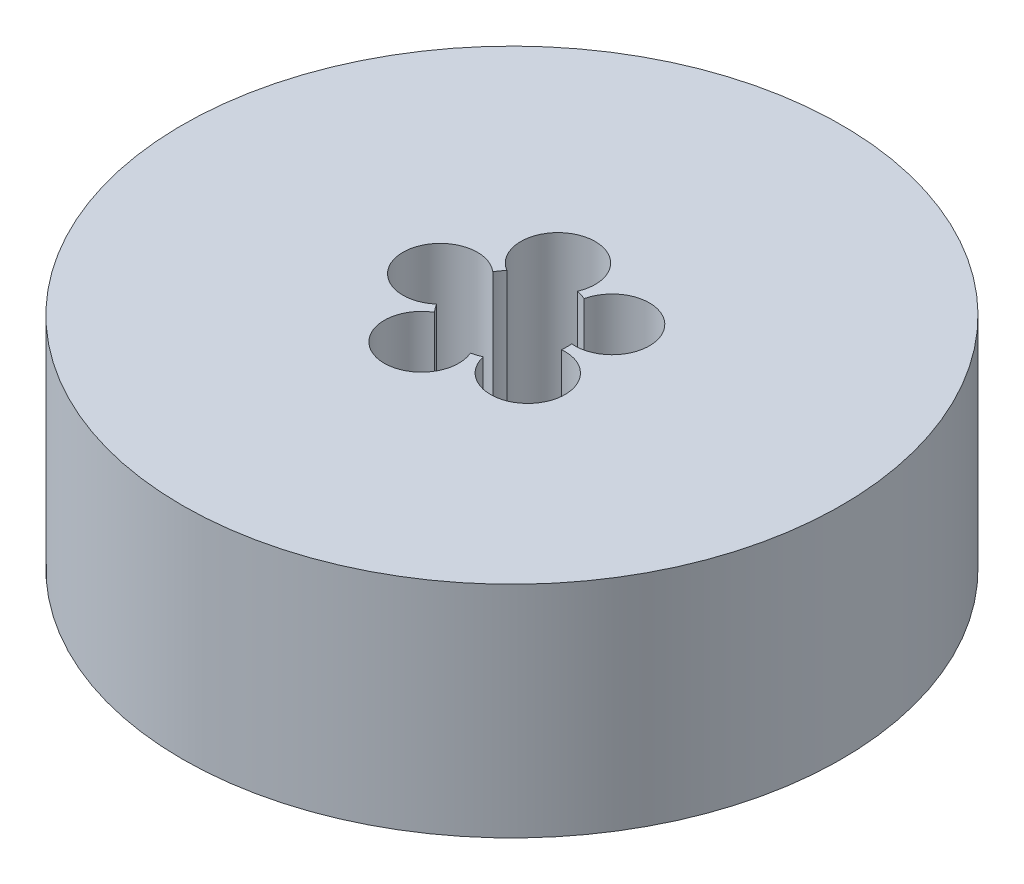
ISO-10303-21;
HEADER;
FILE_DESCRIPTION(('STEP AP214'),'2;1');
FILE_NAME('part.step','',(''),(''),'','','');
FILE_SCHEMA(('AUTOMOTIVE_DESIGN { 1 0 10303 214 1 1 1 1 }'));
ENDSEC;
DATA;
#1=APPLICATION_CONTEXT('core data for automotive mechanical design processes');
#2=APPLICATION_PROTOCOL_DEFINITION('international standard','automotive_design',2000,#1);
#3=PRODUCT_CONTEXT('',#1,'mechanical');
#4=PRODUCT('Part','Part','',(#3));
#5=PRODUCT_RELATED_PRODUCT_CATEGORY('part','',(#4));
#6=PRODUCT_DEFINITION_FORMATION('','',#4);
#7=PRODUCT_DEFINITION_CONTEXT('part definition',#1,'design');
#8=PRODUCT_DEFINITION('design','',#6,#7);
#9=PRODUCT_DEFINITION_SHAPE('','',#8);
#10=(LENGTH_UNIT() NAMED_UNIT(*) SI_UNIT(.MILLI.,.METRE.));
#11=(NAMED_UNIT(*) PLANE_ANGLE_UNIT() SI_UNIT($,.RADIAN.));
#12=(NAMED_UNIT(*) SI_UNIT($,.STERADIAN.) SOLID_ANGLE_UNIT());
#13=UNCERTAINTY_MEASURE_WITH_UNIT(LENGTH_MEASURE(1.E-05),#10,'distance_accuracy_value','');
#14=(GEOMETRIC_REPRESENTATION_CONTEXT(3) GLOBAL_UNCERTAINTY_ASSIGNED_CONTEXT((#13)) GLOBAL_UNIT_ASSIGNED_CONTEXT((#10,
#11,#12)) REPRESENTATION_CONTEXT('',''));
#15=CARTESIAN_POINT('',(0.,0.,0.));
#16=DIRECTION('',(0.,0.,1.));
#17=DIRECTION('',(1.,0.,0.));
#18=AXIS2_PLACEMENT_3D('',#15,#16,#17);
#19=CARTESIAN_POINT('',(0.,30.,0.));
#20=DIRECTION('',(0.,-1.,0.));
#21=DIRECTION('',(0.,0.,-1.));
#22=AXIS2_PLACEMENT_3D('',#19,#20,#21);
#23=CYLINDRICAL_SURFACE('',#22,45.);
#24=CARTESIAN_POINT('',(0.,30.,0.));
#25=DIRECTION('',(0.,1.,0.));
#26=DIRECTION('',(0.,0.,1.));
#27=AXIS2_PLACEMENT_3D('',#24,#25,#26);
#28=CIRCLE('',#27,45.);
#29=CARTESIAN_POINT('',(0.,30.,45.));
#30=VERTEX_POINT('',#29);
#31=EDGE_CURVE('E157',#30,#30,#28,.T.);
#32=ORIENTED_EDGE('',*,*,#31,.F.);
#33=EDGE_LOOP('',(#32));
#34=FACE_BOUND('',#33,.T.);
#35=CARTESIAN_POINT('',(0.,0.,0.));
#36=DIRECTION('',(0.,1.,0.));
#37=DIRECTION('',(0.,0.,1.));
#38=AXIS2_PLACEMENT_3D('',#35,#36,#37);
#39=CIRCLE('',#38,45.);
#40=CARTESIAN_POINT('',(0.,0.,45.));
#41=VERTEX_POINT('',#40);
#42=EDGE_CURVE('E150',#41,#41,#39,.T.);
#43=ORIENTED_EDGE('',*,*,#42,.T.);
#44=EDGE_LOOP('',(#43));
#45=FACE_BOUND('',#44,.T.);
#46=ADVANCED_FACE('F39',(#34,#45),#23,.T.);
#47=CARTESIAN_POINT('',(0.,30.,0.));
#48=DIRECTION('',(0.,1.,0.));
#49=DIRECTION('',(0.,0.,1.));
#50=AXIS2_PLACEMENT_3D('',#47,#48,#49);
#51=PLANE('',#50);
#52=CARTESIAN_POINT('',(-3.02745629020434,30.,-9.31755238387919));
#53=DIRECTION('',(0.,1.,0.));
#54=DIRECTION('',(-0.95105651629515,0.,0.309016994374958));
#55=AXIS2_PLACEMENT_3D('',#52,#53,#54);
#56=CIRCLE('',#55,5.08681048643422);
#57=CARTESIAN_POINT('',(1.64920328847724,30.,-7.3164286720555));
#58=VERTEX_POINT('',#57);
#59=CARTESIAN_POINT('',(-5.63472236044128,30.,-4.94973776282573));
#60=VERTEX_POINT('',#59);
#61=EDGE_CURVE('E194',#58,#60,#56,.T.);
#62=ORIENTED_EDGE('',*,*,#61,.F.);
#63=CARTESIAN_POINT('',(0.,30.,0.));
#64=DIRECTION('',(0.,1.,0.));
#65=DIRECTION('',(0.,0.,1.));
#66=AXIS2_PLACEMENT_3D('',#63,#64,#65);
#67=CIRCLE('',#66,7.5);
#68=CARTESIAN_POINT('',(2.96625538532675,30.,-6.88849250482426));
#69=VERTEX_POINT('',#68);
#70=EDGE_CURVE('E147',#69,#58,#67,.T.);
#71=ORIENTED_EDGE('',*,*,#70,.F.);
#72=CARTESIAN_POINT('',(7.92598346720929,30.,-5.75856406519504));
#73=DIRECTION('',(0.,1.,0.));
#74=DIRECTION('',(-0.58778525229248,0.,-0.809016994374942));
#75=AXIS2_PLACEMENT_3D('',#72,#73,#74);
#76=CIRCLE('',#75,5.08681048643422);
#77=CARTESIAN_POINT('',(7.4679690078856,30.,-0.692415263595586));
#78=VERTEX_POINT('',#77);
#79=EDGE_CURVE('E254',#78,#69,#76,.T.);
#80=ORIENTED_EDGE('',*,*,#79,.F.);
#81=CARTESIAN_POINT('',(7.46796900788561,30.,0.692415263595479));
#82=VERTEX_POINT('',#81);
#83=EDGE_CURVE('E144',#82,#78,#67,.T.);
#84=ORIENTED_EDGE('',*,*,#83,.F.);
#85=CARTESIAN_POINT('',(7.92598346720937,30.,5.75856406519493));
#86=DIRECTION('',(0.,1.,0.));
#87=DIRECTION('',(0.587785252292469,0.,-0.809016994374951));
#88=AXIS2_PLACEMENT_3D('',#85,#86,#87);
#89=CIRCLE('',#88,5.08681048643422);
#90=CARTESIAN_POINT('',(2.96625538532685,30.,6.88849250482422));
#91=VERTEX_POINT('',#90);
#92=EDGE_CURVE('E141',#91,#82,#89,.T.);
#93=ORIENTED_EDGE('',*,*,#92,.F.);
#94=CARTESIAN_POINT('',(1.64920328847734,30.,7.31642867205548));
#95=VERTEX_POINT('',#94);
#96=EDGE_CURVE('E134',#95,#91,#67,.T.);
#97=ORIENTED_EDGE('',*,*,#96,.F.);
#98=CARTESIAN_POINT('',(-3.02745629020421,30.,9.31755238387924));
#99=DIRECTION('',(0.,1.,0.));
#100=DIRECTION('',(0.951056516295155,0.,0.309016994374945));
#101=AXIS2_PLACEMENT_3D('',#98,#99,#100);
#102=CIRCLE('',#101,5.08681048643422);
#103=CARTESIAN_POINT('',(-5.6347223604412,30.,4.94973776282581));
#104=VERTEX_POINT('',#103);
#105=EDGE_CURVE('E111',#104,#95,#102,.T.);
#106=ORIENTED_EDGE('',*,*,#105,.F.);
#107=CARTESIAN_POINT('',(-6.44870532124852,30.,3.82938633199903));
#108=VERTEX_POINT('',#107);
#109=EDGE_CURVE('E145',#108,#104,#67,.T.);
#110=ORIENTED_EDGE('',*,*,#109,.F.);
#111=CARTESIAN_POINT('',(-9.79705435401022,30.,0.));
#112=DIRECTION('',(0.,1.,0.));
#113=DIRECTION('',(0.,0.,1.));
#114=AXIS2_PLACEMENT_3D('',#111,#112,#113);
#115=CIRCLE('',#114,5.08681048643422);
#116=CARTESIAN_POINT('',(-6.44870532124852,30.,-3.82938633199903));
#117=VERTEX_POINT('',#116);
#118=EDGE_CURVE('E153',#117,#108,#115,.T.);
#119=ORIENTED_EDGE('',*,*,#118,.F.);
#120=EDGE_CURVE('E146',#60,#117,#67,.T.);
#121=ORIENTED_EDGE('',*,*,#120,.F.);
#122=EDGE_LOOP('',(#62,#71,#80,#84,#93,#97,#106,#110,#119,#121));
#123=FACE_BOUND('',#122,.T.);
#124=ORIENTED_EDGE('',*,*,#31,.T.);
#125=EDGE_LOOP('',(#124));
#126=FACE_BOUND('',#125,.T.);
#127=ADVANCED_FACE('F139',(#123,#126),#51,.T.);
#128=CARTESIAN_POINT('',(0.,0.,0.));
#129=DIRECTION('',(0.,1.,0.));
#130=DIRECTION('',(0.,0.,1.));
#131=AXIS2_PLACEMENT_3D('',#128,#129,#130);
#132=PLANE('',#131);
#133=CARTESIAN_POINT('',(0.,0.,0.));
#134=DIRECTION('',(0.,1.,0.));
#135=DIRECTION('',(0.,0.,1.));
#136=AXIS2_PLACEMENT_3D('',#133,#134,#135);
#137=CIRCLE('',#136,7.5);
#138=CARTESIAN_POINT('',(0.,0.,7.5));
#139=VERTEX_POINT('',#138);
#140=EDGE_CURVE('E154',#139,#139,#137,.T.);
#141=ORIENTED_EDGE('',*,*,#140,.T.);
#142=EDGE_LOOP('',(#141));
#143=FACE_BOUND('',#142,.T.);
#144=ORIENTED_EDGE('',*,*,#42,.F.);
#145=EDGE_LOOP('',(#144));
#146=FACE_BOUND('',#145,.T.);
#147=ADVANCED_FACE('F213',(#143,#146),#132,.F.);
#148=CARTESIAN_POINT('',(0.,30.,0.));
#149=DIRECTION('',(0.,-1.,0.));
#150=DIRECTION('',(0.,0.,-1.));
#151=AXIS2_PLACEMENT_3D('',#148,#149,#150);
#152=CYLINDRICAL_SURFACE('',#151,7.5);
#153=DIRECTION('',(0.,1.,0.));
#154=VECTOR('',#153,1.);
#155=CARTESIAN_POINT('',(1.64920328847724,16.659027370638,-7.3164286720555));
#156=LINE('',#155,#154);
#157=CARTESIAN_POINT('',(1.64920328847724,3.31805474127601,-7.3164286720555));
#158=VERTEX_POINT('',#157);
#159=EDGE_CURVE('E11',#158,#58,#156,.T.);
#160=ORIENTED_EDGE('',*,*,#159,.F.);
#161=CARTESIAN_POINT('',(0.,3.31805474127601,0.));
#162=DIRECTION('',(0.,1.,0.));
#163=DIRECTION('',(0.,0.,1.));
#164=AXIS2_PLACEMENT_3D('',#161,#162,#163);
#165=CIRCLE('',#164,7.5);
#166=CARTESIAN_POINT('',(-5.63472236044128,3.31805474127601,-4.94973776282573));
#167=VERTEX_POINT('',#166);
#168=EDGE_CURVE('E189',#158,#167,#165,.T.);
#169=ORIENTED_EDGE('',*,*,#168,.T.);
#170=DIRECTION('',(0.,1.,0.));
#171=VECTOR('',#170,1.);
#172=CARTESIAN_POINT('',(-5.63472236044128,16.659027370638,-4.94973776282573));
#173=LINE('',#172,#171);
#174=EDGE_CURVE('E46',#60,#167,#173,.F.);
#175=ORIENTED_EDGE('',*,*,#174,.F.);
#176=ORIENTED_EDGE('',*,*,#120,.T.);
#177=DIRECTION('',(0.,1.,0.));
#178=VECTOR('',#177,1.);
#179=CARTESIAN_POINT('',(-6.44870532124853,16.659027370638,-3.82938633199903));
#180=LINE('',#179,#178);
#181=CARTESIAN_POINT('',(-6.44870532124852,3.31805474127601,-3.82938633199903));
#182=VERTEX_POINT('',#181);
#183=EDGE_CURVE('E168',#182,#117,#180,.T.);
#184=ORIENTED_EDGE('',*,*,#183,.F.);
#185=CARTESIAN_POINT('',(0.,3.31805474127601,0.));
#186=DIRECTION('',(0.,1.,0.));
#187=DIRECTION('',(0.,0.,1.));
#188=AXIS2_PLACEMENT_3D('',#185,#186,#187);
#189=CIRCLE('',#188,7.5);
#190=CARTESIAN_POINT('',(-6.44870532124852,3.31805474127601,3.82938633199903));
#191=VERTEX_POINT('',#190);
#192=EDGE_CURVE('E165',#182,#191,#189,.T.);
#193=ORIENTED_EDGE('',*,*,#192,.T.);
#194=DIRECTION('',(0.,1.,0.));
#195=VECTOR('',#194,1.);
#196=CARTESIAN_POINT('',(-6.44870532124853,16.659027370638,3.82938633199903));
#197=LINE('',#196,#195);
#198=EDGE_CURVE('E170',#108,#191,#197,.F.);
#199=ORIENTED_EDGE('',*,*,#198,.F.);
#200=ORIENTED_EDGE('',*,*,#109,.T.);
#201=DIRECTION('',(0.,1.,0.));
#202=VECTOR('',#201,1.);
#203=CARTESIAN_POINT('',(-5.6347223604412,16.659027370638,4.94973776282581));
#204=LINE('',#203,#202);
#205=CARTESIAN_POINT('',(-5.6347223604412,3.31805474127601,4.94973776282581));
#206=VERTEX_POINT('',#205);
#207=EDGE_CURVE('E121',#206,#104,#204,.T.);
#208=ORIENTED_EDGE('',*,*,#207,.F.);
#209=CARTESIAN_POINT('',(0.,3.31805474127601,0.));
#210=DIRECTION('',(0.,1.,0.));
#211=DIRECTION('',(0.,0.,1.));
#212=AXIS2_PLACEMENT_3D('',#209,#210,#211);
#213=CIRCLE('',#212,7.5);
#214=CARTESIAN_POINT('',(1.64920328847734,3.31805474127601,7.31642867205548));
#215=VERTEX_POINT('',#214);
#216=EDGE_CURVE('E136',#206,#215,#213,.T.);
#217=ORIENTED_EDGE('',*,*,#216,.T.);
#218=DIRECTION('',(0.,1.,0.));
#219=VECTOR('',#218,1.);
#220=CARTESIAN_POINT('',(1.64920328847734,16.659027370638,7.31642867205548));
#221=LINE('',#220,#219);
#222=EDGE_CURVE('E117',#95,#215,#221,.F.);
#223=ORIENTED_EDGE('',*,*,#222,.F.);
#224=ORIENTED_EDGE('',*,*,#96,.T.);
#225=DIRECTION('',(0.,1.,0.));
#226=VECTOR('',#225,1.);
#227=CARTESIAN_POINT('',(2.96625538532685,16.659027370638,6.88849250482422));
#228=LINE('',#227,#226);
#229=CARTESIAN_POINT('',(2.96625538532685,3.31805474127601,6.88849250482422));
#230=VERTEX_POINT('',#229);
#231=EDGE_CURVE('E182',#230,#91,#228,.T.);
#232=ORIENTED_EDGE('',*,*,#231,.F.);
#233=CARTESIAN_POINT('',(0.,3.31805474127601,0.));
#234=DIRECTION('',(0.,1.,0.));
#235=DIRECTION('',(0.,0.,1.));
#236=AXIS2_PLACEMENT_3D('',#233,#234,#235);
#237=CIRCLE('',#236,7.5);
#238=CARTESIAN_POINT('',(7.46796900788561,3.31805474127601,0.692415263595479));
#239=VERTEX_POINT('',#238);
#240=EDGE_CURVE('E174',#230,#239,#237,.T.);
#241=ORIENTED_EDGE('',*,*,#240,.T.);
#242=DIRECTION('',(0.,1.,0.));
#243=VECTOR('',#242,1.);
#244=CARTESIAN_POINT('',(7.46796900788561,16.659027370638,0.692415263595479));
#245=LINE('',#244,#243);
#246=EDGE_CURVE('E177',#82,#239,#245,.F.);
#247=ORIENTED_EDGE('',*,*,#246,.F.);
#248=ORIENTED_EDGE('',*,*,#83,.T.);
#249=DIRECTION('',(0.,1.,0.));
#250=VECTOR('',#249,1.);
#251=CARTESIAN_POINT('',(7.4679690078856,16.659027370638,-0.692415263595586));
#252=LINE('',#251,#250);
#253=CARTESIAN_POINT('',(7.4679690078856,3.31805474127601,-0.692415263595586));
#254=VERTEX_POINT('',#253);
#255=EDGE_CURVE('E187',#254,#78,#252,.T.);
#256=ORIENTED_EDGE('',*,*,#255,.F.);
#257=CARTESIAN_POINT('',(0.,3.31805474127601,0.));
#258=DIRECTION('',(0.,1.,0.));
#259=DIRECTION('',(0.,0.,1.));
#260=AXIS2_PLACEMENT_3D('',#257,#258,#259);
#261=CIRCLE('',#260,7.5);
#262=CARTESIAN_POINT('',(2.96625538532675,3.31805474127601,-6.88849250482426));
#263=VERTEX_POINT('',#262);
#264=EDGE_CURVE('E181',#254,#263,#261,.T.);
#265=ORIENTED_EDGE('',*,*,#264,.T.);
#266=DIRECTION('',(0.,1.,0.));
#267=VECTOR('',#266,1.);
#268=CARTESIAN_POINT('',(2.96625538532675,16.659027370638,-6.88849250482426));
#269=LINE('',#268,#267);
#270=EDGE_CURVE('E186',#69,#263,#269,.F.);
#271=ORIENTED_EDGE('',*,*,#270,.F.);
#272=ORIENTED_EDGE('',*,*,#70,.T.);
#273=EDGE_LOOP('',(#160,#169,#175,#176,#184,#193,#199,#200,#208,#217,#223,#224,#232,#241,#247,
#248,#256,#265,#271,#272));
#274=FACE_BOUND('',#273,.T.);
#275=ORIENTED_EDGE('',*,*,#140,.F.);
#276=EDGE_LOOP('',(#275));
#277=FACE_BOUND('',#276,.T.);
#278=ADVANCED_FACE('F135',(#274,#277),#152,.F.);
#279=CARTESIAN_POINT('',(-9.79705435401022,3.31805474127601,0.));
#280=DIRECTION('',(0.,1.,0.));
#281=DIRECTION('',(0.,0.,1.));
#282=AXIS2_PLACEMENT_3D('',#279,#280,#281);
#283=CYLINDRICAL_SURFACE('',#282,5.08681048643422);
#284=ORIENTED_EDGE('',*,*,#183,.T.);
#285=ORIENTED_EDGE('',*,*,#118,.T.);
#286=ORIENTED_EDGE('',*,*,#198,.T.);
#287=CARTESIAN_POINT('',(-9.79705435401022,3.31805474127601,0.));
#288=DIRECTION('',(0.,1.,0.));
#289=DIRECTION('',(0.,0.,1.));
#290=AXIS2_PLACEMENT_3D('',#287,#288,#289);
#291=CIRCLE('',#290,5.08681048643422);
#292=EDGE_CURVE('E158',#182,#191,#291,.T.);
#293=ORIENTED_EDGE('',*,*,#292,.F.);
#294=EDGE_LOOP('',(#284,#285,#286,#293));
#295=FACE_BOUND('',#294,.T.);
#296=ADVANCED_FACE('F221',(#295),#283,.F.);
#297=CARTESIAN_POINT('',(-9.79705435401022,3.31805474127601,0.));
#298=DIRECTION('',(0.,1.,0.));
#299=DIRECTION('',(0.,0.,1.));
#300=AXIS2_PLACEMENT_3D('',#297,#298,#299);
#301=PLANE('',#300);
#302=ORIENTED_EDGE('',*,*,#292,.T.);
#303=ORIENTED_EDGE('',*,*,#192,.F.);
#304=EDGE_LOOP('',(#302,#303));
#305=FACE_BOUND('',#304,.T.);
#306=ADVANCED_FACE('F227',(#305),#301,.T.);
#307=CARTESIAN_POINT('',(-3.02745629020421,3.31805474127601,9.31755238387924));
#308=DIRECTION('',(0.,1.,0.));
#309=DIRECTION('',(0.,0.,1.));
#310=AXIS2_PLACEMENT_3D('',#307,#308,#309);
#311=CYLINDRICAL_SURFACE('',#310,5.08681048643422);
#312=ORIENTED_EDGE('',*,*,#207,.T.);
#313=ORIENTED_EDGE('',*,*,#105,.T.);
#314=ORIENTED_EDGE('',*,*,#222,.T.);
#315=CARTESIAN_POINT('',(-3.02745629020421,3.31805474127601,9.31755238387924));
#316=DIRECTION('',(0.,1.,0.));
#317=DIRECTION('',(0.951056516295155,0.,0.309016994374945));
#318=AXIS2_PLACEMENT_3D('',#315,#316,#317);
#319=CIRCLE('',#318,5.08681048643422);
#320=EDGE_CURVE('E127',#206,#215,#319,.T.);
#321=ORIENTED_EDGE('',*,*,#320,.F.);
#322=EDGE_LOOP('',(#312,#313,#314,#321));
#323=FACE_BOUND('',#322,.T.);
#324=ADVANCED_FACE('F116',(#323),#311,.F.);
#325=CARTESIAN_POINT('',(-3.02745629020421,3.31805474127601,9.31755238387924));
#326=DIRECTION('',(0.,1.,0.));
#327=DIRECTION('',(0.951056516295155,0.,0.309016994374945));
#328=AXIS2_PLACEMENT_3D('',#325,#326,#327);
#329=PLANE('',#328);
#330=ORIENTED_EDGE('',*,*,#320,.T.);
#331=ORIENTED_EDGE('',*,*,#216,.F.);
#332=EDGE_LOOP('',(#330,#331));
#333=FACE_BOUND('',#332,.T.);
#334=ADVANCED_FACE('F234',(#333),#329,.T.);
#335=CARTESIAN_POINT('',(7.92598346720937,3.31805474127601,5.75856406519493));
#336=DIRECTION('',(0.,1.,0.));
#337=DIRECTION('',(0.,0.,1.));
#338=AXIS2_PLACEMENT_3D('',#335,#336,#337);
#339=CYLINDRICAL_SURFACE('',#338,5.08681048643422);
#340=ORIENTED_EDGE('',*,*,#231,.T.);
#341=ORIENTED_EDGE('',*,*,#92,.T.);
#342=ORIENTED_EDGE('',*,*,#246,.T.);
#343=CARTESIAN_POINT('',(7.92598346720937,3.31805474127601,5.75856406519493));
#344=DIRECTION('',(0.,1.,0.));
#345=DIRECTION('',(0.587785252292469,0.,-0.809016994374951));
#346=AXIS2_PLACEMENT_3D('',#343,#344,#345);
#347=CIRCLE('',#346,5.08681048643422);
#348=EDGE_CURVE('E130',#230,#239,#347,.T.);
#349=ORIENTED_EDGE('',*,*,#348,.F.);
#350=EDGE_LOOP('',(#340,#341,#342,#349));
#351=FACE_BOUND('',#350,.T.);
#352=ADVANCED_FACE('F240',(#351),#339,.F.);
#353=CARTESIAN_POINT('',(7.92598346720937,3.31805474127601,5.75856406519493));
#354=DIRECTION('',(0.,1.,0.));
#355=DIRECTION('',(0.587785252292469,0.,-0.809016994374951));
#356=AXIS2_PLACEMENT_3D('',#353,#354,#355);
#357=PLANE('',#356);
#358=ORIENTED_EDGE('',*,*,#348,.T.);
#359=ORIENTED_EDGE('',*,*,#240,.F.);
#360=EDGE_LOOP('',(#358,#359));
#361=FACE_BOUND('',#360,.T.);
#362=ADVANCED_FACE('F245',(#361),#357,.T.);
#363=CARTESIAN_POINT('',(7.92598346720929,3.31805474127601,-5.75856406519504));
#364=DIRECTION('',(0.,1.,0.));
#365=DIRECTION('',(0.,0.,1.));
#366=AXIS2_PLACEMENT_3D('',#363,#364,#365);
#367=CYLINDRICAL_SURFACE('',#366,5.08681048643422);
#368=ORIENTED_EDGE('',*,*,#255,.T.);
#369=ORIENTED_EDGE('',*,*,#79,.T.);
#370=ORIENTED_EDGE('',*,*,#270,.T.);
#371=CARTESIAN_POINT('',(7.92598346720929,3.31805474127601,-5.75856406519504));
#372=DIRECTION('',(0.,1.,0.));
#373=DIRECTION('',(-0.58778525229248,0.,-0.809016994374942));
#374=AXIS2_PLACEMENT_3D('',#371,#372,#373);
#375=CIRCLE('',#374,5.08681048643422);
#376=EDGE_CURVE('E56',#254,#263,#375,.T.);
#377=ORIENTED_EDGE('',*,*,#376,.F.);
#378=EDGE_LOOP('',(#368,#369,#370,#377));
#379=FACE_BOUND('',#378,.T.);
#380=ADVANCED_FACE('F266',(#379),#367,.F.);
#381=CARTESIAN_POINT('',(7.92598346720929,3.31805474127601,-5.75856406519504));
#382=DIRECTION('',(0.,1.,0.));
#383=DIRECTION('',(-0.58778525229248,0.,-0.809016994374942));
#384=AXIS2_PLACEMENT_3D('',#381,#382,#383);
#385=PLANE('',#384);
#386=ORIENTED_EDGE('',*,*,#376,.T.);
#387=ORIENTED_EDGE('',*,*,#264,.F.);
#388=EDGE_LOOP('',(#386,#387));
#389=FACE_BOUND('',#388,.T.);
#390=ADVANCED_FACE('F204',(#389),#385,.T.);
#391=CARTESIAN_POINT('',(-3.02745629020434,3.31805474127601,-9.31755238387919));
#392=DIRECTION('',(0.,1.,0.));
#393=DIRECTION('',(0.,0.,1.));
#394=AXIS2_PLACEMENT_3D('',#391,#392,#393);
#395=CYLINDRICAL_SURFACE('',#394,5.08681048643422);
#396=ORIENTED_EDGE('',*,*,#159,.T.);
#397=ORIENTED_EDGE('',*,*,#61,.T.);
#398=ORIENTED_EDGE('',*,*,#174,.T.);
#399=CARTESIAN_POINT('',(-3.02745629020434,3.31805474127601,-9.31755238387919));
#400=DIRECTION('',(0.,1.,0.));
#401=DIRECTION('',(-0.95105651629515,0.,0.309016994374958));
#402=AXIS2_PLACEMENT_3D('',#399,#400,#401);
#403=CIRCLE('',#402,5.08681048643422);
#404=EDGE_CURVE('E55',#158,#167,#403,.T.);
#405=ORIENTED_EDGE('',*,*,#404,.F.);
#406=EDGE_LOOP('',(#396,#397,#398,#405));
#407=FACE_BOUND('',#406,.T.);
#408=ADVANCED_FACE('F193',(#407),#395,.F.);
#409=CARTESIAN_POINT('',(-3.02745629020434,3.31805474127601,-9.31755238387919));
#410=DIRECTION('',(0.,1.,0.));
#411=DIRECTION('',(-0.95105651629515,0.,0.309016994374958));
#412=AXIS2_PLACEMENT_3D('',#409,#410,#411);
#413=PLANE('',#412);
#414=ORIENTED_EDGE('',*,*,#404,.T.);
#415=ORIENTED_EDGE('',*,*,#168,.F.);
#416=EDGE_LOOP('',(#414,#415));
#417=FACE_BOUND('',#416,.T.);
#418=ADVANCED_FACE('F196',(#417),#413,.T.);
#419=CLOSED_SHELL('',(#46,#127,#147,#278,#296,#306,#324,#334,#352,#362,#380,#390,#408,#418));
#420=MANIFOLD_SOLID_BREP('B2',#419);
#421=ADVANCED_BREP_SHAPE_REPRESENTATION('',(#18,#420),#14);
#422=SHAPE_DEFINITION_REPRESENTATION(#9,#421);
ENDSEC;
END-ISO-10303-21;
